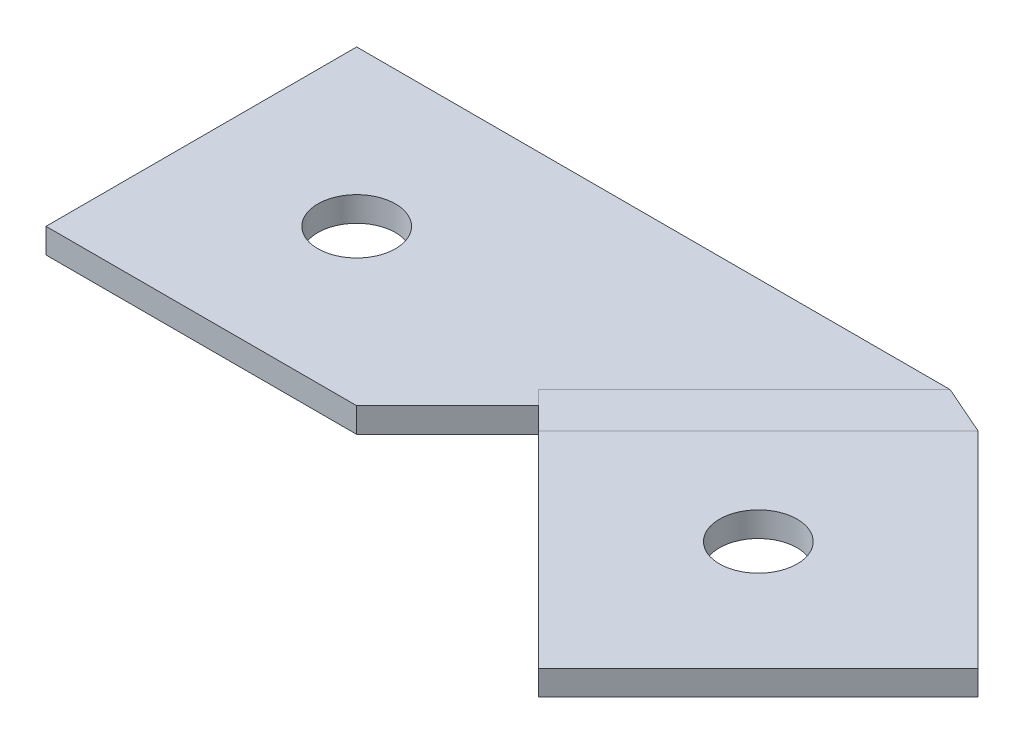
ISO-10303-21;
HEADER;
FILE_DESCRIPTION(('STEP AP214'),'2;1');
FILE_NAME('part.step','',(''),(''),'','','');
FILE_SCHEMA(('AUTOMOTIVE_DESIGN { 1 0 10303 214 1 1 1 1 }'));
ENDSEC;
DATA;
#1=APPLICATION_CONTEXT('core data for automotive mechanical design processes');
#2=APPLICATION_PROTOCOL_DEFINITION('international standard','automotive_design',2000,#1);
#3=PRODUCT_CONTEXT('',#1,'mechanical');
#4=PRODUCT('Part','Part','',(#3));
#5=PRODUCT_RELATED_PRODUCT_CATEGORY('part','',(#4));
#6=PRODUCT_DEFINITION_FORMATION('','',#4);
#7=PRODUCT_DEFINITION_CONTEXT('part definition',#1,'design');
#8=PRODUCT_DEFINITION('design','',#6,#7);
#9=PRODUCT_DEFINITION_SHAPE('','',#8);
#10=(LENGTH_UNIT() NAMED_UNIT(*) SI_UNIT(.MILLI.,.METRE.));
#11=(NAMED_UNIT(*) PLANE_ANGLE_UNIT() SI_UNIT($,.RADIAN.));
#12=(NAMED_UNIT(*) SI_UNIT($,.STERADIAN.) SOLID_ANGLE_UNIT());
#13=UNCERTAINTY_MEASURE_WITH_UNIT(LENGTH_MEASURE(1.E-05),#10,'distance_accuracy_value','');
#14=(GEOMETRIC_REPRESENTATION_CONTEXT(3) GLOBAL_UNCERTAINTY_ASSIGNED_CONTEXT((#13)) GLOBAL_UNIT_ASSIGNED_CONTEXT((#10,
#11,#12)) REPRESENTATION_CONTEXT('',''));
#15=CARTESIAN_POINT('',(0.,0.,0.));
#16=DIRECTION('',(0.,0.,1.));
#17=DIRECTION('',(1.,0.,0.));
#18=AXIS2_PLACEMENT_3D('',#15,#16,#17);
#19=CARTESIAN_POINT('',(39.6452763200141,-1.59999999999987,4.64527632001408));
#20=DIRECTION('',(-0.707106781186547,0.,0.707106781186548));
#21=DIRECTION('',(0.,1.,0.));
#22=AXIS2_PLACEMENT_3D('',#19,#20,#21);
#23=PLANE('',#22);
#24=CARTESIAN_POINT('',(26.4011663083901,-3.20000000000001,-8.59883369160995));
#25=DIRECTION('',(0.,1.,0.));
#26=VECTOR('',#25,1.);
#27=LINE('',#24,#26);
#28=CARTESIAN_POINT('',(26.4011663083901,-3.20000000000001,-8.59883369160995));
#29=VERTEX_POINT('',#28);
#30=CARTESIAN_POINT('',(26.4011663083901,-1.6,-8.59883369160996));
#31=VERTEX_POINT('',#30);
#32=EDGE_CURVE('E11',#29,#31,#27,.T.);
#33=ORIENTED_EDGE('',*,*,#32,.T.);
#34=DIRECTION('',(0.707106781186548,0.,0.707106781186547));
#35=VECTOR('',#34,1.);
#36=CARTESIAN_POINT('',(39.6452763200141,-1.59999999999987,4.64527632001408));
#37=LINE('',#36,#35);
#38=CARTESIAN_POINT('',(39.6452763200141,-1.59999999999987,4.64527632001408));
#39=VERTEX_POINT('',#38);
#40=EDGE_CURVE('E137',#31,#39,#37,.T.);
#41=ORIENTED_EDGE('',*,*,#40,.T.);
#42=DIRECTION('',(0.,-1.,0.));
#43=VECTOR('',#42,1.);
#44=CARTESIAN_POINT('',(39.6452763200141,-1.59999999999987,4.64527632001408));
#45=LINE('',#44,#43);
#46=CARTESIAN_POINT('',(39.6452763200141,-3.19999999999988,4.64527632001409));
#47=VERTEX_POINT('',#46);
#48=EDGE_CURVE('E139',#39,#47,#45,.T.);
#49=ORIENTED_EDGE('',*,*,#48,.T.);
#50=DIRECTION('',(0.707106781186548,0.,0.707106781186547));
#51=VECTOR('',#50,1.);
#52=CARTESIAN_POINT('',(39.6452763200141,-3.19999999999988,4.64527632001409));
#53=LINE('',#52,#51);
#54=EDGE_CURVE('E174',#29,#47,#53,.T.);
#55=ORIENTED_EDGE('',*,*,#54,.F.);
#56=EDGE_LOOP('',(#33,#41,#49,#55));
#57=FACE_BOUND('',#56,.T.);
#58=ADVANCED_FACE('F39',(#57),#23,.F.);
#59=CARTESIAN_POINT('',(11.3610050725522,-1.60000000000001,4.64527632001409));
#60=DIRECTION('',(0.707106781186547,0.,-0.707106781186548));
#61=DIRECTION('',(0.,-1.,0.));
#62=AXIS2_PLACEMENT_3D('',#59,#60,#61);
#63=PLANE('',#62);
#64=DIRECTION('',(0.,1.,0.));
#65=VECTOR('',#64,1.);
#66=CARTESIAN_POINT('',(12.2590306846591,-3.2,5.54330193212101));
#67=LINE('',#66,#65);
#68=CARTESIAN_POINT('',(12.2590306846591,-3.2,5.54330193212101));
#69=VERTEX_POINT('',#68);
#70=CARTESIAN_POINT('',(12.2590306846591,-1.6,5.54330193212099));
#71=VERTEX_POINT('',#70);
#72=EDGE_CURVE('E138',#69,#71,#67,.T.);
#73=ORIENTED_EDGE('',*,*,#72,.F.);
#74=DIRECTION('',(-0.707106781186548,0.,-0.707106781186547));
#75=VECTOR('',#74,1.);
#76=CARTESIAN_POINT('',(11.3610050725522,-3.20000000000001,4.6452763200141));
#77=LINE('',#76,#75);
#78=CARTESIAN_POINT('',(25.5031406962832,-3.19999999999987,18.787411943745));
#79=VERTEX_POINT('',#78);
#80=EDGE_CURVE('E158',#79,#69,#77,.T.);
#81=ORIENTED_EDGE('',*,*,#80,.F.);
#82=DIRECTION('',(0.,-1.,0.));
#83=VECTOR('',#82,1.);
#84=CARTESIAN_POINT('',(25.5031406962831,-1.59999999999987,18.787411943745));
#85=LINE('',#84,#83);
#86=CARTESIAN_POINT('',(25.5031406962831,-1.59999999999987,18.787411943745));
#87=VERTEX_POINT('',#86);
#88=EDGE_CURVE('E146',#87,#79,#85,.T.);
#89=ORIENTED_EDGE('',*,*,#88,.F.);
#90=DIRECTION('',(-0.707106781186548,0.,-0.707106781186547));
#91=VECTOR('',#90,1.);
#92=CARTESIAN_POINT('',(11.3610050725522,-1.60000000000001,4.64527632001409));
#93=LINE('',#92,#91);
#94=EDGE_CURVE('E134',#87,#71,#93,.T.);
#95=ORIENTED_EDGE('',*,*,#94,.T.);
#96=EDGE_LOOP('',(#73,#81,#89,#95));
#97=FACE_BOUND('',#96,.T.);
#98=ADVANCED_FACE('F143',(#97),#63,.F.);
#99=CARTESIAN_POINT('',(8.00314069628311,-1.60000000000001,8.00314069628312));
#100=DIRECTION('',(0.,-1.,0.));
#101=DIRECTION('',(-0.707106781186547,0.,0.707106781186548));
#102=AXIS2_PLACEMENT_3D('',#99,#100,#101);
#103=PLANE('',#102);
#104=CARTESIAN_POINT('',(25.5031406962831,-1.59999999999994,4.64527632001404));
#105=DIRECTION('',(0.,1.,0.));
#106=DIRECTION('',(-0.707106781186547,0.,0.707106781186548));
#107=AXIS2_PLACEMENT_3D('',#104,#105,#106);
#108=CIRCLE('',#107,2.5);
#109=CARTESIAN_POINT('',(23.7353737433168,-1.59999999999994,6.41304327298041));
#110=VERTEX_POINT('',#109);
#111=EDGE_CURVE('E177',#110,#110,#108,.T.);
#112=ORIENTED_EDGE('',*,*,#111,.F.);
#113=EDGE_LOOP('',(#112));
#114=FACE_BOUND('',#113,.T.);
#115=DIRECTION('',(-0.707106781186548,0.,0.707106781186548));
#116=VECTOR('',#115,1.);
#117=CARTESIAN_POINT('',(8.90116630839005,-1.6,8.90116630839006));
#118=LINE('',#117,#116);
#119=EDGE_CURVE('E122',#31,#71,#118,.T.);
#120=ORIENTED_EDGE('',*,*,#119,.T.);
#121=ORIENTED_EDGE('',*,*,#94,.F.);
#122=DIRECTION('',(-0.707106781186547,0.,0.707106781186548));
#123=VECTOR('',#122,1.);
#124=CARTESIAN_POINT('',(25.5031406962831,-1.59999999999987,18.787411943745));
#125=LINE('',#124,#123);
#126=EDGE_CURVE('E147',#39,#87,#125,.T.);
#127=ORIENTED_EDGE('',*,*,#126,.F.);
#128=ORIENTED_EDGE('',*,*,#40,.F.);
#129=EDGE_LOOP('',(#120,#121,#127,#128));
#130=FACE_BOUND('',#129,.T.);
#131=ADVANCED_FACE('F133',(#114,#130),#103,.F.);
#132=CARTESIAN_POINT('',(8.00314069628312,-3.20000000000001,8.00314069628313));
#133=DIRECTION('',(0.,-1.,0.));
#134=DIRECTION('',(-0.707106781186547,0.,0.707106781186548));
#135=AXIS2_PLACEMENT_3D('',#132,#133,#134);
#136=PLANE('',#135);
#137=CARTESIAN_POINT('',(25.5031406962832,-3.19999999999994,4.64527632001405));
#138=DIRECTION('',(0.,1.,0.));
#139=DIRECTION('',(-0.707106781186547,0.,0.707106781186548));
#140=AXIS2_PLACEMENT_3D('',#137,#138,#139);
#141=CIRCLE('',#140,2.5);
#142=CARTESIAN_POINT('',(23.7353737433168,-3.19999999999994,6.41304327298042));
#143=VERTEX_POINT('',#142);
#144=EDGE_CURVE('E182',#143,#143,#141,.T.);
#145=ORIENTED_EDGE('',*,*,#144,.T.);
#146=EDGE_LOOP('',(#145));
#147=FACE_BOUND('',#146,.T.);
#148=ORIENTED_EDGE('',*,*,#54,.T.);
#149=DIRECTION('',(-0.707106781186547,0.,0.707106781186548));
#150=VECTOR('',#149,1.);
#151=CARTESIAN_POINT('',(25.5031406962832,-3.19999999999987,18.787411943745));
#152=LINE('',#151,#150);
#153=EDGE_CURVE('E176',#47,#79,#152,.T.);
#154=ORIENTED_EDGE('',*,*,#153,.T.);
#155=ORIENTED_EDGE('',*,*,#80,.T.);
#156=DIRECTION('',(0.707106781186548,0.,-0.707106781186548));
#157=VECTOR('',#156,1.);
#158=CARTESIAN_POINT('',(12.2590306846591,-3.2,5.54330193212101));
#159=LINE('',#158,#157);
#160=EDGE_CURVE('E48',#69,#29,#159,.T.);
#161=ORIENTED_EDGE('',*,*,#160,.T.);
#162=EDGE_LOOP('',(#148,#154,#155,#161));
#163=FACE_BOUND('',#162,.T.);
#164=ADVANCED_FACE('F196',(#147,#163),#136,.T.);
#165=CARTESIAN_POINT('',(25.5031406962831,-1.59999999999987,18.787411943745));
#166=DIRECTION('',(-0.707106781186548,0.,-0.707106781186547));
#167=DIRECTION('',(0.500000000000003,-0.707106781186548,-0.499999999999997));
#168=AXIS2_PLACEMENT_3D('',#165,#166,#167);
#169=PLANE('',#168);
#170=ORIENTED_EDGE('',*,*,#153,.F.);
#171=ORIENTED_EDGE('',*,*,#48,.F.);
#172=ORIENTED_EDGE('',*,*,#126,.T.);
#173=ORIENTED_EDGE('',*,*,#88,.T.);
#174=EDGE_LOOP('',(#170,#171,#172,#173));
#175=FACE_BOUND('',#174,.T.);
#176=ADVANCED_FACE('F195',(#175),#169,.F.);
#177=CARTESIAN_POINT('',(25.5031406962831,11.865645361033,4.64527632001397));
#178=DIRECTION('',(0.,-1.,0.));
#179=DIRECTION('',(-0.707106781186547,0.,0.707106781186548));
#180=AXIS2_PLACEMENT_3D('',#177,#178,#179);
#181=CYLINDRICAL_SURFACE('',#180,2.5);
#182=ORIENTED_EDGE('',*,*,#144,.F.);
#183=EDGE_LOOP('',(#182));
#184=FACE_BOUND('',#183,.T.);
#185=ORIENTED_EDGE('',*,*,#111,.T.);
#186=EDGE_LOOP('',(#185));
#187=FACE_BOUND('',#186,.T.);
#188=ADVANCED_FACE('F277',(#184,#187),#181,.F.);
#189=CARTESIAN_POINT('',(-15.,-1.6,-10.));
#190=DIRECTION('',(-1.,0.,0.));
#191=DIRECTION('',(0.,0.,1.));
#192=AXIS2_PLACEMENT_3D('',#189,#190,#191);
#193=PLANE('',#192);
#194=DIRECTION('',(0.,0.,1.));
#195=VECTOR('',#194,1.);
#196=CARTESIAN_POINT('',(-15.,-3.2,-10.));
#197=LINE('',#196,#195);
#198=CARTESIAN_POINT('',(-15.,-3.2,-10.));
#199=VERTEX_POINT('',#198);
#200=CARTESIAN_POINT('',(-15.,-3.2,10.));
#201=VERTEX_POINT('',#200);
#202=EDGE_CURVE('E223',#199,#201,#197,.T.);
#203=ORIENTED_EDGE('',*,*,#202,.T.);
#204=DIRECTION('',(0.,-1.,0.));
#205=VECTOR('',#204,1.);
#206=CARTESIAN_POINT('',(-15.,-1.6,10.));
#207=LINE('',#206,#205);
#208=CARTESIAN_POINT('',(-15.,-1.6,10.));
#209=VERTEX_POINT('',#208);
#210=EDGE_CURVE('E244',#209,#201,#207,.T.);
#211=ORIENTED_EDGE('',*,*,#210,.F.);
#212=DIRECTION('',(0.,0.,1.));
#213=VECTOR('',#212,1.);
#214=CARTESIAN_POINT('',(-15.,-1.6,-10.));
#215=LINE('',#214,#213);
#216=CARTESIAN_POINT('',(-15.,-1.6,-10.));
#217=VERTEX_POINT('',#216);
#218=EDGE_CURVE('E247',#217,#209,#215,.T.);
#219=ORIENTED_EDGE('',*,*,#218,.F.);
#220=DIRECTION('',(0.,-1.,0.));
#221=VECTOR('',#220,1.);
#222=CARTESIAN_POINT('',(-15.,-1.6,-10.));
#223=LINE('',#222,#221);
#224=EDGE_CURVE('E187',#217,#199,#223,.T.);
#225=ORIENTED_EDGE('',*,*,#224,.T.);
#226=EDGE_LOOP('',(#203,#211,#219,#225));
#227=FACE_BOUND('',#226,.T.);
#228=ADVANCED_FACE('F280',(#227),#193,.T.);
#229=CARTESIAN_POINT('',(-15.,-1.6,10.));
#230=DIRECTION('',(0.,0.,1.));
#231=DIRECTION('',(1.,0.,0.));
#232=AXIS2_PLACEMENT_3D('',#229,#230,#231);
#233=PLANE('',#232);
#234=DIRECTION('',(1.,0.,0.));
#235=VECTOR('',#234,1.);
#236=CARTESIAN_POINT('',(-15.,-3.2,10.));
#237=LINE('',#236,#235);
#238=CARTESIAN_POINT('',(5.,-3.2,10.));
#239=VERTEX_POINT('',#238);
#240=EDGE_CURVE('E219',#201,#239,#237,.T.);
#241=ORIENTED_EDGE('',*,*,#240,.T.);
#242=DIRECTION('',(0.,-1.,0.));
#243=VECTOR('',#242,1.);
#244=CARTESIAN_POINT('',(5.,-1.6,10.));
#245=LINE('',#244,#243);
#246=CARTESIAN_POINT('',(5.,-1.6,10.));
#247=VERTEX_POINT('',#246);
#248=EDGE_CURVE('E216',#247,#239,#245,.T.);
#249=ORIENTED_EDGE('',*,*,#248,.F.);
#250=DIRECTION('',(1.,0.,0.));
#251=VECTOR('',#250,1.);
#252=CARTESIAN_POINT('',(-15.,-1.6,10.));
#253=LINE('',#252,#251);
#254=EDGE_CURVE('E241',#209,#247,#253,.T.);
#255=ORIENTED_EDGE('',*,*,#254,.F.);
#256=ORIENTED_EDGE('',*,*,#210,.T.);
#257=EDGE_LOOP('',(#241,#249,#255,#256));
#258=FACE_BOUND('',#257,.T.);
#259=ADVANCED_FACE('F329',(#258),#233,.T.);
#260=CARTESIAN_POINT('',(5.,-1.6,10.));
#261=DIRECTION('',(0.707106781186548,0.,0.707106781186548));
#262=DIRECTION('',(0.707106781186548,0.,-0.707106781186548));
#263=AXIS2_PLACEMENT_3D('',#260,#261,#262);
#264=PLANE('',#263);
#265=DIRECTION('',(0.707106781186548,0.,-0.707106781186547));
#266=VECTOR('',#265,1.);
#267=CARTESIAN_POINT('',(5.,-1.6,10.));
#268=LINE('',#267,#266);
#269=CARTESIAN_POINT('',(10.8578643762691,-1.6,4.14213562373095));
#270=VERTEX_POINT('',#269);
#271=EDGE_CURVE('E238',#247,#270,#268,.T.);
#272=ORIENTED_EDGE('',*,*,#271,.F.);
#273=ORIENTED_EDGE('',*,*,#248,.T.);
#274=DIRECTION('',(0.707106781186548,0.,-0.707106781186547));
#275=VECTOR('',#274,1.);
#276=CARTESIAN_POINT('',(5.,-3.2,10.));
#277=LINE('',#276,#275);
#278=CARTESIAN_POINT('',(10.8578643762691,-3.2,4.14213562373095));
#279=VERTEX_POINT('',#278);
#280=EDGE_CURVE('E205',#239,#279,#277,.T.);
#281=ORIENTED_EDGE('',*,*,#280,.T.);
#282=DIRECTION('',(0.,1.,0.));
#283=VECTOR('',#282,1.);
#284=CARTESIAN_POINT('',(10.8578643762691,-3.2,4.14213562373095));
#285=LINE('',#284,#283);
#286=EDGE_CURVE('E208',#279,#270,#285,.T.);
#287=ORIENTED_EDGE('',*,*,#286,.T.);
#288=EDGE_LOOP('',(#272,#273,#281,#287));
#289=FACE_BOUND('',#288,.T.);
#290=ADVANCED_FACE('F214',(#289),#264,.T.);
#291=CARTESIAN_POINT('',(-5.,-1.6,0.));
#292=DIRECTION('',(0.,-1.,0.));
#293=DIRECTION('',(0.,0.,1.));
#294=AXIS2_PLACEMENT_3D('',#291,#292,#293);
#295=CYLINDRICAL_SURFACE('',#294,2.5);
#296=CARTESIAN_POINT('',(-5.,-1.6,0.));
#297=DIRECTION('',(0.,1.,0.));
#298=DIRECTION('',(0.,0.,1.));
#299=AXIS2_PLACEMENT_3D('',#296,#297,#298);
#300=CIRCLE('',#299,2.5);
#301=CARTESIAN_POINT('',(-5.,-1.6,2.5));
#302=VERTEX_POINT('',#301);
#303=EDGE_CURVE('E232',#302,#302,#300,.T.);
#304=ORIENTED_EDGE('',*,*,#303,.T.);
#305=EDGE_LOOP('',(#304));
#306=FACE_BOUND('',#305,.T.);
#307=CARTESIAN_POINT('',(-5.,-3.2,0.));
#308=DIRECTION('',(0.,1.,0.));
#309=DIRECTION('',(0.,0.,1.));
#310=AXIS2_PLACEMENT_3D('',#307,#308,#309);
#311=CIRCLE('',#310,2.5);
#312=CARTESIAN_POINT('',(-5.,-3.2,2.5));
#313=VERTEX_POINT('',#312);
#314=EDGE_CURVE('E235',#313,#313,#311,.T.);
#315=ORIENTED_EDGE('',*,*,#314,.F.);
#316=EDGE_LOOP('',(#315));
#317=FACE_BOUND('',#316,.T.);
#318=ADVANCED_FACE('F350',(#306,#317),#295,.F.);
#319=CARTESIAN_POINT('',(0.,-1.6,0.));
#320=DIRECTION('',(0.,-1.,0.));
#321=DIRECTION('',(0.,0.,1.));
#322=AXIS2_PLACEMENT_3D('',#319,#320,#321);
#323=PLANE('',#322);
#324=ORIENTED_EDGE('',*,*,#303,.F.);
#325=EDGE_LOOP('',(#324));
#326=FACE_BOUND('',#325,.T.);
#327=DIRECTION('',(-0.707106781186548,0.,0.707106781186548));
#328=VECTOR('',#327,1.);
#329=CARTESIAN_POINT('',(24.1019743878931,-1.6,-10.8980256121069));
#330=LINE('',#329,#328);
#331=CARTESIAN_POINT('',(23.2039487757862,-1.6,-10.));
#332=VERTEX_POINT('',#331);
#333=CARTESIAN_POINT('',(9.95983876416214,-1.6,3.24411001162404));
#334=VERTEX_POINT('',#333);
#335=EDGE_CURVE('E231',#332,#334,#330,.T.);
#336=ORIENTED_EDGE('',*,*,#335,.F.);
#337=DIRECTION('',(-1.,0.,0.));
#338=VECTOR('',#337,1.);
#339=CARTESIAN_POINT('',(-15.,-1.6,-10.));
#340=LINE('',#339,#338);
#341=EDGE_CURVE('E222',#332,#217,#340,.T.);
#342=ORIENTED_EDGE('',*,*,#341,.T.);
#343=ORIENTED_EDGE('',*,*,#218,.T.);
#344=ORIENTED_EDGE('',*,*,#254,.T.);
#345=ORIENTED_EDGE('',*,*,#271,.T.);
#346=DIRECTION('',(-0.707106781186548,0.,-0.707106781186548));
#347=VECTOR('',#346,1.);
#348=CARTESIAN_POINT('',(3.35786437626905,-1.6,-3.35786437626905));
#349=LINE('',#348,#347);
#350=EDGE_CURVE('E125',#270,#334,#349,.T.);
#351=ORIENTED_EDGE('',*,*,#350,.T.);
#352=EDGE_LOOP('',(#336,#342,#343,#344,#345,#351));
#353=FACE_BOUND('',#352,.T.);
#354=ADVANCED_FACE('F360',(#326,#353),#323,.F.);
#355=CARTESIAN_POINT('',(0.,-3.2,0.));
#356=DIRECTION('',(0.,-1.,0.));
#357=DIRECTION('',(0.,0.,1.));
#358=AXIS2_PLACEMENT_3D('',#355,#356,#357);
#359=PLANE('',#358);
#360=ORIENTED_EDGE('',*,*,#314,.T.);
#361=EDGE_LOOP('',(#360));
#362=FACE_BOUND('',#361,.T.);
#363=DIRECTION('',(0.707106781186547,0.,0.707106781186547));
#364=VECTOR('',#363,1.);
#365=CARTESIAN_POINT('',(9.95983876416214,-3.2,3.24411001162404));
#366=LINE('',#365,#364);
#367=CARTESIAN_POINT('',(9.95983876416214,-3.2,3.24411001162404));
#368=VERTEX_POINT('',#367);
#369=EDGE_CURVE('E200',#368,#279,#366,.T.);
#370=ORIENTED_EDGE('',*,*,#369,.T.);
#371=ORIENTED_EDGE('',*,*,#280,.F.);
#372=ORIENTED_EDGE('',*,*,#240,.F.);
#373=ORIENTED_EDGE('',*,*,#202,.F.);
#374=DIRECTION('',(-1.,0.,0.));
#375=VECTOR('',#374,1.);
#376=CARTESIAN_POINT('',(-15.,-3.2,-10.));
#377=LINE('',#376,#375);
#378=CARTESIAN_POINT('',(23.2039487757862,-3.2,-10.));
#379=VERTEX_POINT('',#378);
#380=EDGE_CURVE('E212',#379,#199,#377,.T.);
#381=ORIENTED_EDGE('',*,*,#380,.F.);
#382=DIRECTION('',(-0.707106781186548,0.,0.707106781186548));
#383=VECTOR('',#382,1.);
#384=CARTESIAN_POINT('',(24.1019743878931,-3.2,-10.8980256121069));
#385=LINE('',#384,#383);
#386=EDGE_CURVE('E127',#379,#368,#385,.T.);
#387=ORIENTED_EDGE('',*,*,#386,.T.);
#388=EDGE_LOOP('',(#370,#371,#372,#373,#381,#387));
#389=FACE_BOUND('',#388,.T.);
#390=ADVANCED_FACE('F203',(#362,#389),#359,.T.);
#391=CARTESIAN_POINT('',(-15.,-1.6,-10.));
#392=DIRECTION('',(0.,0.,-1.));
#393=DIRECTION('',(-1.,0.,0.));
#394=AXIS2_PLACEMENT_3D('',#391,#392,#393);
#395=PLANE('',#394);
#396=ORIENTED_EDGE('',*,*,#380,.T.);
#397=ORIENTED_EDGE('',*,*,#224,.F.);
#398=ORIENTED_EDGE('',*,*,#341,.F.);
#399=CARTESIAN_POINT('',(23.2039487757862,-3.2,-10.));
#400=DIRECTION('',(0.,1.,0.));
#401=VECTOR('',#400,1.);
#402=LINE('',#399,#401);
#403=EDGE_CURVE('E218',#379,#332,#402,.T.);
#404=ORIENTED_EDGE('',*,*,#403,.F.);
#405=EDGE_LOOP('',(#396,#397,#398,#404));
#406=FACE_BOUND('',#405,.T.);
#407=ADVANCED_FACE('F265',(#406),#395,.T.);
#408=CARTESIAN_POINT('',(23.2039487757862,-1.6,-10.));
#409=DIRECTION('',(0.401391893734024,0.,-0.91590640768837));
#410=DIRECTION('',(0.91590640768837,0.,0.401391893734024));
#411=AXIS2_PLACEMENT_3D('',#408,#409,#410);
#412=PLANE('',#411);
#413=ORIENTED_EDGE('',*,*,#403,.T.);
#414=CARTESIAN_POINT('',(23.2039487757862,-1.6,-10.));
#415=DIRECTION('',(0.91590640768837,0.,0.401391893734024));
#416=VECTOR('',#415,1.);
#417=LINE('',#414,#416);
#418=EDGE_CURVE('E128',#332,#31,#417,.T.);
#419=ORIENTED_EDGE('',*,*,#418,.T.);
#420=ORIENTED_EDGE('',*,*,#32,.F.);
#421=CARTESIAN_POINT('',(23.2039487757862,-3.2,-10.));
#422=DIRECTION('',(0.91590640768837,0.,0.401391893734024));
#423=VECTOR('',#422,1.);
#424=LINE('',#421,#423);
#425=EDGE_CURVE('E55',#379,#29,#424,.T.);
#426=ORIENTED_EDGE('',*,*,#425,.F.);
#427=EDGE_LOOP('',(#413,#419,#420,#426));
#428=FACE_BOUND('',#427,.T.);
#429=ADVANCED_FACE('F275',(#428),#412,.T.);
#430=CARTESIAN_POINT('',(9.95983876416214,-1.6,3.24411001162404));
#431=DIRECTION('',(-0.707106781186549,0.,0.707106781186546));
#432=DIRECTION('',(-0.707106781186546,0.,-0.707106781186549));
#433=AXIS2_PLACEMENT_3D('',#430,#431,#432);
#434=PLANE('',#433);
#435=DIRECTION('',(-0.707106781186546,0.,-0.707106781186549));
#436=VECTOR('',#435,1.);
#437=CARTESIAN_POINT('',(9.95983876416214,-3.2,3.24411001162404));
#438=LINE('',#437,#436);
#439=EDGE_CURVE('E64',#69,#279,#438,.T.);
#440=ORIENTED_EDGE('',*,*,#439,.F.);
#441=ORIENTED_EDGE('',*,*,#72,.T.);
#442=DIRECTION('',(-0.707106781186546,0.,-0.707106781186549));
#443=VECTOR('',#442,1.);
#444=CARTESIAN_POINT('',(9.95983876416214,-1.6,3.24411001162404));
#445=LINE('',#444,#443);
#446=EDGE_CURVE('E119',#71,#270,#445,.T.);
#447=ORIENTED_EDGE('',*,*,#446,.T.);
#448=ORIENTED_EDGE('',*,*,#286,.F.);
#449=EDGE_LOOP('',(#440,#441,#447,#448));
#450=FACE_BOUND('',#449,.T.);
#451=ADVANCED_FACE('F149',(#450),#434,.T.);
#452=CARTESIAN_POINT('',(17.7314897302226,-1.6,-2.2283490339395));
#453=DIRECTION('',(0.,1.,0.));
#454=DIRECTION('',(0.,0.,-1.));
#455=AXIS2_PLACEMENT_3D('',#452,#453,#454);
#456=PLANE('',#455);
#457=ORIENTED_EDGE('',*,*,#119,.F.);
#458=ORIENTED_EDGE('',*,*,#418,.F.);
#459=ORIENTED_EDGE('',*,*,#335,.T.);
#460=ORIENTED_EDGE('',*,*,#350,.F.);
#461=ORIENTED_EDGE('',*,*,#446,.F.);
#462=EDGE_LOOP('',(#457,#458,#459,#460,#461));
#463=FACE_BOUND('',#462,.T.);
#464=ADVANCED_FACE('F121',(#463),#456,.T.);
#465=CARTESIAN_POINT('',(17.7314897302226,-3.2,-2.2283490339395));
#466=DIRECTION('',(0.,1.,0.));
#467=DIRECTION('',(0.,0.,-1.));
#468=AXIS2_PLACEMENT_3D('',#465,#466,#467);
#469=PLANE('',#468);
#470=ORIENTED_EDGE('',*,*,#160,.F.);
#471=ORIENTED_EDGE('',*,*,#439,.T.);
#472=ORIENTED_EDGE('',*,*,#369,.F.);
#473=ORIENTED_EDGE('',*,*,#386,.F.);
#474=ORIENTED_EDGE('',*,*,#425,.T.);
#475=EDGE_LOOP('',(#470,#471,#472,#473,#474));
#476=FACE_BOUND('',#475,.T.);
#477=ADVANCED_FACE('F197',(#476),#469,.F.);
#478=CLOSED_SHELL('',(#58,#98,#131,#164,#176,#188,#228,#259,#290,#318,#354,#390,#407,#429,#451,
#464,#477));
#479=MANIFOLD_SOLID_BREP('B2',#478);
#480=ADVANCED_BREP_SHAPE_REPRESENTATION('',(#18,#479),#14);
#481=SHAPE_DEFINITION_REPRESENTATION(#9,#480);
ENDSEC;
END-ISO-10303-21;
